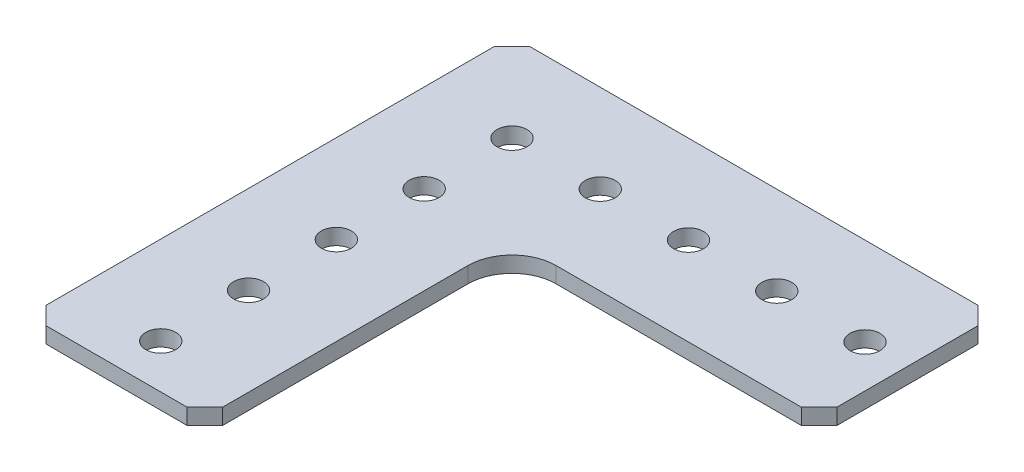
ISO-10303-21;
HEADER;
FILE_DESCRIPTION(('STEP AP214'),'2;1');
FILE_NAME('part.step','',(''),(''),'','','');
FILE_SCHEMA(('AUTOMOTIVE_DESIGN { 1 0 10303 214 1 1 1 1 }'));
ENDSEC;
DATA;
#1=APPLICATION_CONTEXT('core data for automotive mechanical design processes');
#2=APPLICATION_PROTOCOL_DEFINITION('international standard','automotive_design',2000,#1);
#3=PRODUCT_CONTEXT('',#1,'mechanical');
#4=PRODUCT('Part','Part','',(#3));
#5=PRODUCT_RELATED_PRODUCT_CATEGORY('part','',(#4));
#6=PRODUCT_DEFINITION_FORMATION('','',#4);
#7=PRODUCT_DEFINITION_CONTEXT('part definition',#1,'design');
#8=PRODUCT_DEFINITION('design','',#6,#7);
#9=PRODUCT_DEFINITION_SHAPE('','',#8);
#10=(LENGTH_UNIT() NAMED_UNIT(*) SI_UNIT(.MILLI.,.METRE.));
#11=(NAMED_UNIT(*) PLANE_ANGLE_UNIT() SI_UNIT($,.RADIAN.));
#12=(NAMED_UNIT(*) SI_UNIT($,.STERADIAN.) SOLID_ANGLE_UNIT());
#13=UNCERTAINTY_MEASURE_WITH_UNIT(LENGTH_MEASURE(1.E-05),#10,'distance_accuracy_value','');
#14=(GEOMETRIC_REPRESENTATION_CONTEXT(3) GLOBAL_UNCERTAINTY_ASSIGNED_CONTEXT((#13)) GLOBAL_UNIT_ASSIGNED_CONTEXT((#10,
#11,#12)) REPRESENTATION_CONTEXT('',''));
#15=CARTESIAN_POINT('',(0.,0.,0.));
#16=DIRECTION('',(0.,0.,1.));
#17=DIRECTION('',(1.,0.,0.));
#18=AXIS2_PLACEMENT_3D('',#15,#16,#17);
#19=CARTESIAN_POINT('',(-7.73686434568832,2.286,-7.93225292998995));
#20=DIRECTION('',(0.,1.,0.));
#21=DIRECTION('',(0.,0.,1.));
#22=AXIS2_PLACEMENT_3D('',#19,#20,#21);
#23=PLANE('',#22);
#24=CARTESIAN_POINT('',(-26.7868643456951,2.286,10.927247070011));
#25=DIRECTION('',(0.,1.,0.));
#26=DIRECTION('',(0.,0.,1.));
#27=AXIS2_PLACEMENT_3D('',#24,#25,#26);
#28=CIRCLE('',#27,2.15900000000763);
#29=CARTESIAN_POINT('',(-26.7868643456951,2.286,13.0862470700186));
#30=VERTEX_POINT('',#29);
#31=EDGE_CURVE('E352',#30,#30,#28,.T.);
#32=ORIENTED_EDGE('',*,*,#31,.F.);
#33=EDGE_LOOP('',(#32));
#34=FACE_BOUND('',#33,.T.);
#35=CARTESIAN_POINT('',(-26.7868643456954,2.286,-14.3457529299895));
#36=DIRECTION('',(0.,1.,0.));
#37=DIRECTION('',(0.,0.,1.));
#38=AXIS2_PLACEMENT_3D('',#35,#36,#37);
#39=CIRCLE('',#38,2.15900000000757);
#40=CARTESIAN_POINT('',(-26.7868643456954,2.286,-12.1867529299819));
#41=VERTEX_POINT('',#40);
#42=EDGE_CURVE('E368',#41,#41,#39,.T.);
#43=ORIENTED_EDGE('',*,*,#42,.F.);
#44=EDGE_LOOP('',(#43));
#45=FACE_BOUND('',#44,.T.);
#46=CARTESIAN_POINT('',(11.3131356543094,2.286,-26.9822529299906));
#47=DIRECTION('',(0.,1.,0.));
#48=DIRECTION('',(0.,0.,1.));
#49=AXIS2_PLACEMENT_3D('',#46,#47,#48);
#50=CIRCLE('',#49,2.15900000000558);
#51=CARTESIAN_POINT('',(11.3131356543094,2.286,-24.8232529299851));
#52=VERTEX_POINT('',#51);
#53=EDGE_CURVE('E384',#52,#52,#50,.T.);
#54=ORIENTED_EDGE('',*,*,#53,.F.);
#55=EDGE_LOOP('',(#54));
#56=FACE_BOUND('',#55,.T.);
#57=CARTESIAN_POINT('',(-14.086864345694,2.286,-26.9822529299899));
#58=DIRECTION('',(0.,1.,0.));
#59=DIRECTION('',(0.,0.,1.));
#60=AXIS2_PLACEMENT_3D('',#57,#58,#59);
#61=CIRCLE('',#60,2.15900000000892);
#62=CARTESIAN_POINT('',(-14.086864345694,2.286,-24.823252929981));
#63=VERTEX_POINT('',#62);
#64=EDGE_CURVE('E400',#63,#63,#61,.T.);
#65=ORIENTED_EDGE('',*,*,#64,.F.);
#66=EDGE_LOOP('',(#65));
#67=FACE_BOUND('',#66,.T.);
#68=DIRECTION('',(-0.707106781186537,0.,0.707106781186558));
#69=VECTOR('',#68,1.);
#70=CARTESIAN_POINT('',(-39.4868643456896,2.286,-37.1422529299886));
#71=LINE('',#70,#69);
#72=CARTESIAN_POINT('',(-36.9468643456897,2.286,-39.6822529299886));
#73=VERTEX_POINT('',#72);
#74=CARTESIAN_POINT('',(-39.4868643456896,2.286,-37.1422529299886));
#75=VERTEX_POINT('',#74);
#76=EDGE_CURVE('E200',#73,#75,#71,.T.);
#77=ORIENTED_EDGE('',*,*,#76,.T.);
#78=DIRECTION('',(0.,0.,1.));
#79=VECTOR('',#78,1.);
#80=CARTESIAN_POINT('',(-39.4868643456887,2.286,27.3737470700114));
#81=LINE('',#80,#79);
#82=CARTESIAN_POINT('',(-39.4868643456887,2.286,27.3737470700114));
#83=VERTEX_POINT('',#82);
#84=EDGE_CURVE('E112',#75,#83,#81,.T.);
#85=ORIENTED_EDGE('',*,*,#84,.T.);
#86=DIRECTION('',(0.707106781186556,0.,0.707106781186539));
#87=VECTOR('',#86,1.);
#88=CARTESIAN_POINT('',(-36.9468643456887,2.286,29.9137470700114));
#89=LINE('',#88,#87);
#90=CARTESIAN_POINT('',(-36.9468643456887,2.286,29.9137470700114));
#91=VERTEX_POINT('',#90);
#92=EDGE_CURVE('E237',#83,#91,#89,.T.);
#93=ORIENTED_EDGE('',*,*,#92,.T.);
#94=DIRECTION('',(1.,0.,0.));
#95=VECTOR('',#94,1.);
#96=CARTESIAN_POINT('',(-16.6268643456887,2.286,29.9137470700111));
#97=LINE('',#96,#95);
#98=CARTESIAN_POINT('',(-16.6268643456887,2.286,29.9137470700111));
#99=VERTEX_POINT('',#98);
#100=EDGE_CURVE('E257',#91,#99,#97,.T.);
#101=ORIENTED_EDGE('',*,*,#100,.T.);
#102=DIRECTION('',(0.707106781186543,0.,-0.707106781186552));
#103=VECTOR('',#102,1.);
#104=CARTESIAN_POINT('',(-14.0868643456887,2.286,27.3737470700111));
#105=LINE('',#104,#103);
#106=CARTESIAN_POINT('',(-14.0868643456887,2.286,27.3737470700111));
#107=VERTEX_POINT('',#106);
#108=EDGE_CURVE('E253',#99,#107,#105,.T.);
#109=ORIENTED_EDGE('',*,*,#108,.T.);
#110=DIRECTION('',(0.,0.,-1.));
#111=VECTOR('',#110,1.);
#112=CARTESIAN_POINT('',(-14.0868643456883,2.286,-7.93225292998995));
#113=LINE('',#112,#111);
#114=CARTESIAN_POINT('',(-14.0868643456883,2.286,-7.93225292998995));
#115=VERTEX_POINT('',#114);
#116=EDGE_CURVE('E256',#107,#115,#113,.T.);
#117=ORIENTED_EDGE('',*,*,#116,.T.);
#118=CARTESIAN_POINT('',(-7.73686434568832,2.286,-7.93225292998995));
#119=DIRECTION('',(0.,-1.,0.));
#120=DIRECTION('',(0.,0.,1.));
#121=AXIS2_PLACEMENT_3D('',#118,#119,#120);
#122=CIRCLE('',#121,6.35);
#123=CARTESIAN_POINT('',(-7.73686434568832,2.286,-14.2822529299899));
#124=VERTEX_POINT('',#123);
#125=EDGE_CURVE('E261',#115,#124,#122,.T.);
#126=ORIENTED_EDGE('',*,*,#125,.T.);
#127=DIRECTION('',(1.,0.,0.));
#128=VECTOR('',#127,1.);
#129=CARTESIAN_POINT('',(27.5691356543107,2.286,-14.2822529299896));
#130=LINE('',#129,#128);
#131=CARTESIAN_POINT('',(27.5691356543107,2.286,-14.2822529299896));
#132=VERTEX_POINT('',#131);
#133=EDGE_CURVE('E268',#124,#132,#130,.T.);
#134=ORIENTED_EDGE('',*,*,#133,.T.);
#135=DIRECTION('',(0.707106781186542,0.,-0.707106781186553));
#136=VECTOR('',#135,1.);
#137=CARTESIAN_POINT('',(30.1091356543107,2.286,-16.8222529299896));
#138=LINE('',#137,#136);
#139=CARTESIAN_POINT('',(30.1091356543107,2.286,-16.8222529299896));
#140=VERTEX_POINT('',#139);
#141=EDGE_CURVE('E143',#132,#140,#138,.T.);
#142=ORIENTED_EDGE('',*,*,#141,.T.);
#143=DIRECTION('',(0.,0.,-1.));
#144=VECTOR('',#143,1.);
#145=CARTESIAN_POINT('',(30.1091356543104,2.286,-37.1422529299896));
#146=LINE('',#145,#144);
#147=CARTESIAN_POINT('',(30.1091356543104,2.286,-37.1422529299896));
#148=VERTEX_POINT('',#147);
#149=EDGE_CURVE('E137',#140,#148,#146,.T.);
#150=ORIENTED_EDGE('',*,*,#149,.T.);
#151=DIRECTION('',(-0.707106781186555,0.,-0.70710678118654));
#152=VECTOR('',#151,1.);
#153=CARTESIAN_POINT('',(27.5691356543103,2.286,-39.6822529299896));
#154=LINE('',#153,#152);
#155=CARTESIAN_POINT('',(27.5691356543103,2.286,-39.6822529299896));
#156=VERTEX_POINT('',#155);
#157=EDGE_CURVE('E141',#148,#156,#154,.T.);
#158=ORIENTED_EDGE('',*,*,#157,.T.);
#159=DIRECTION('',(-1.,0.,0.));
#160=VECTOR('',#159,1.);
#161=CARTESIAN_POINT('',(-36.9468643456897,2.286,-39.6822529299886));
#162=LINE('',#161,#160);
#163=EDGE_CURVE('E57',#156,#73,#162,.T.);
#164=ORIENTED_EDGE('',*,*,#163,.T.);
#165=EDGE_LOOP('',(#77,#85,#93,#101,#109,#117,#126,#134,#142,#150,#158,#164));
#166=FACE_BOUND('',#165,.T.);
#167=CARTESIAN_POINT('',(-26.7868643456955,2.286,-26.9822529299897));
#168=DIRECTION('',(0.,1.,0.));
#169=DIRECTION('',(0.,0.,1.));
#170=AXIS2_PLACEMENT_3D('',#167,#168,#169);
#171=CIRCLE('',#170,2.15900000001037);
#172=CARTESIAN_POINT('',(-26.7868643456955,2.286,-24.8232529299794));
#173=VERTEX_POINT('',#172);
#174=EDGE_CURVE('E170',#173,#173,#171,.T.);
#175=ORIENTED_EDGE('',*,*,#174,.F.);
#176=EDGE_LOOP('',(#175));
#177=FACE_BOUND('',#176,.T.);
#178=CARTESIAN_POINT('',(-1.3868643456925,2.286,-26.9822529299901));
#179=DIRECTION('',(0.,1.,0.));
#180=DIRECTION('',(0.,0.,1.));
#181=AXIS2_PLACEMENT_3D('',#178,#179,#180);
#182=CIRCLE('',#181,2.15900000000748);
#183=CARTESIAN_POINT('',(-1.3868643456925,2.286,-24.8232529299826));
#184=VERTEX_POINT('',#183);
#185=EDGE_CURVE('E392',#184,#184,#182,.T.);
#186=ORIENTED_EDGE('',*,*,#185,.F.);
#187=EDGE_LOOP('',(#186));
#188=FACE_BOUND('',#187,.T.);
#189=CARTESIAN_POINT('',(24.0131356543105,2.286,-26.9822529299905));
#190=DIRECTION('',(0.,1.,0.));
#191=DIRECTION('',(0.,0.,1.));
#192=AXIS2_PLACEMENT_3D('',#189,#190,#191);
#193=CIRCLE('',#192,2.1590000000046);
#194=CARTESIAN_POINT('',(24.0131356543105,2.286,-24.8232529299859));
#195=VERTEX_POINT('',#194);
#196=EDGE_CURVE('E376',#195,#195,#193,.T.);
#197=ORIENTED_EDGE('',*,*,#196,.F.);
#198=EDGE_LOOP('',(#197));
#199=FACE_BOUND('',#198,.T.);
#200=CARTESIAN_POINT('',(-26.7868643456953,2.286,-1.70925292998925));
#201=DIRECTION('',(0.,1.,0.));
#202=DIRECTION('',(0.,0.,1.));
#203=AXIS2_PLACEMENT_3D('',#200,#201,#202);
#204=CIRCLE('',#203,2.1590000000076);
#205=CARTESIAN_POINT('',(-26.7868643456953,2.286,0.449747070018347));
#206=VERTEX_POINT('',#205);
#207=EDGE_CURVE('E360',#206,#206,#204,.T.);
#208=ORIENTED_EDGE('',*,*,#207,.F.);
#209=EDGE_LOOP('',(#208));
#210=FACE_BOUND('',#209,.T.);
#211=CARTESIAN_POINT('',(-26.7868643456948,2.286,23.5637470700112));
#212=DIRECTION('',(0.,1.,0.));
#213=DIRECTION('',(0.,0.,1.));
#214=AXIS2_PLACEMENT_3D('',#211,#212,#213);
#215=CIRCLE('',#214,2.15900000000766);
#216=CARTESIAN_POINT('',(-26.7868643456948,2.286,25.7227470700189));
#217=VERTEX_POINT('',#216);
#218=EDGE_CURVE('E341',#217,#217,#215,.T.);
#219=ORIENTED_EDGE('',*,*,#218,.F.);
#220=EDGE_LOOP('',(#219));
#221=FACE_BOUND('',#220,.T.);
#222=ADVANCED_FACE('F39',(#34,#45,#56,#67,#166,#177,#188,#199,#210,#221),#23,.T.);
#223=CARTESIAN_POINT('',(-7.73686434568832,0.,-7.93225292998995));
#224=DIRECTION('',(0.,1.,0.));
#225=DIRECTION('',(0.,0.,1.));
#226=AXIS2_PLACEMENT_3D('',#223,#224,#225);
#227=PLANE('',#226);
#228=DIRECTION('',(-0.707106781186537,0.,0.707106781186558));
#229=VECTOR('',#228,1.);
#230=CARTESIAN_POINT('',(-39.4868643456896,0.,-37.1422529299886));
#231=LINE('',#230,#229);
#232=CARTESIAN_POINT('',(-36.9468643456897,0.,-39.6822529299886));
#233=VERTEX_POINT('',#232);
#234=CARTESIAN_POINT('',(-39.4868643456896,0.,-37.1422529299886));
#235=VERTEX_POINT('',#234);
#236=EDGE_CURVE('E165',#233,#235,#231,.T.);
#237=ORIENTED_EDGE('',*,*,#236,.F.);
#238=DIRECTION('',(-1.,0.,0.));
#239=VECTOR('',#238,1.);
#240=CARTESIAN_POINT('',(-36.9468643456897,0.,-39.6822529299886));
#241=LINE('',#240,#239);
#242=CARTESIAN_POINT('',(27.5691356543103,0.,-39.6822529299896));
#243=VERTEX_POINT('',#242);
#244=EDGE_CURVE('E104',#243,#233,#241,.T.);
#245=ORIENTED_EDGE('',*,*,#244,.F.);
#246=DIRECTION('',(-0.707106781186555,0.,-0.70710678118654));
#247=VECTOR('',#246,1.);
#248=CARTESIAN_POINT('',(27.5691356543103,0.,-39.6822529299896));
#249=LINE('',#248,#247);
#250=CARTESIAN_POINT('',(30.1091356543104,0.,-37.1422529299896));
#251=VERTEX_POINT('',#250);
#252=EDGE_CURVE('E98',#251,#243,#249,.T.);
#253=ORIENTED_EDGE('',*,*,#252,.F.);
#254=DIRECTION('',(0.,0.,-1.));
#255=VECTOR('',#254,1.);
#256=CARTESIAN_POINT('',(30.1091356543104,0.,-37.1422529299896));
#257=LINE('',#256,#255);
#258=CARTESIAN_POINT('',(30.1091356543107,0.,-16.8222529299896));
#259=VERTEX_POINT('',#258);
#260=EDGE_CURVE('E152',#259,#251,#257,.T.);
#261=ORIENTED_EDGE('',*,*,#260,.F.);
#262=DIRECTION('',(0.707106781186542,0.,-0.707106781186553));
#263=VECTOR('',#262,1.);
#264=CARTESIAN_POINT('',(30.1091356543107,0.,-16.8222529299896));
#265=LINE('',#264,#263);
#266=CARTESIAN_POINT('',(27.5691356543107,0.,-14.2822529299896));
#267=VERTEX_POINT('',#266);
#268=EDGE_CURVE('E191',#267,#259,#265,.T.);
#269=ORIENTED_EDGE('',*,*,#268,.F.);
#270=DIRECTION('',(1.,0.,0.));
#271=VECTOR('',#270,1.);
#272=CARTESIAN_POINT('',(27.5691356543107,0.,-14.2822529299896));
#273=LINE('',#272,#271);
#274=CARTESIAN_POINT('',(-7.73686434568832,0.,-14.2822529299899));
#275=VERTEX_POINT('',#274);
#276=EDGE_CURVE('E188',#275,#267,#273,.T.);
#277=ORIENTED_EDGE('',*,*,#276,.F.);
#278=CARTESIAN_POINT('',(-7.73686434568832,0.,-7.93225292998995));
#279=DIRECTION('',(0.,-1.,0.));
#280=DIRECTION('',(0.,0.,1.));
#281=AXIS2_PLACEMENT_3D('',#278,#279,#280);
#282=CIRCLE('',#281,6.35);
#283=CARTESIAN_POINT('',(-14.0868643456883,0.,-7.93225292998995));
#284=VERTEX_POINT('',#283);
#285=EDGE_CURVE('E185',#284,#275,#282,.T.);
#286=ORIENTED_EDGE('',*,*,#285,.F.);
#287=DIRECTION('',(0.,0.,-1.));
#288=VECTOR('',#287,1.);
#289=CARTESIAN_POINT('',(-14.0868643456883,0.,-7.93225292998995));
#290=LINE('',#289,#288);
#291=CARTESIAN_POINT('',(-14.0868643456887,0.,27.3737470700111));
#292=VERTEX_POINT('',#291);
#293=EDGE_CURVE('E182',#292,#284,#290,.T.);
#294=ORIENTED_EDGE('',*,*,#293,.F.);
#295=DIRECTION('',(0.707106781186543,0.,-0.707106781186552));
#296=VECTOR('',#295,1.);
#297=CARTESIAN_POINT('',(-14.0868643456887,0.,27.3737470700111));
#298=LINE('',#297,#296);
#299=CARTESIAN_POINT('',(-16.6268643456887,0.,29.9137470700111));
#300=VERTEX_POINT('',#299);
#301=EDGE_CURVE('E179',#300,#292,#298,.T.);
#302=ORIENTED_EDGE('',*,*,#301,.F.);
#303=DIRECTION('',(1.,0.,0.));
#304=VECTOR('',#303,1.);
#305=CARTESIAN_POINT('',(-16.6268643456887,0.,29.9137470700111));
#306=LINE('',#305,#304);
#307=CARTESIAN_POINT('',(-36.9468643456887,0.,29.9137470700114));
#308=VERTEX_POINT('',#307);
#309=EDGE_CURVE('E176',#308,#300,#306,.T.);
#310=ORIENTED_EDGE('',*,*,#309,.F.);
#311=DIRECTION('',(0.707106781186556,0.,0.707106781186539));
#312=VECTOR('',#311,1.);
#313=CARTESIAN_POINT('',(-36.9468643456887,0.,29.9137470700114));
#314=LINE('',#313,#312);
#315=CARTESIAN_POINT('',(-39.4868643456887,0.,27.3737470700114));
#316=VERTEX_POINT('',#315);
#317=EDGE_CURVE('E173',#316,#308,#314,.T.);
#318=ORIENTED_EDGE('',*,*,#317,.F.);
#319=DIRECTION('',(0.,0.,1.));
#320=VECTOR('',#319,1.);
#321=CARTESIAN_POINT('',(-39.4868643456887,0.,27.3737470700114));
#322=LINE('',#321,#320);
#323=EDGE_CURVE('E169',#235,#316,#322,.T.);
#324=ORIENTED_EDGE('',*,*,#323,.F.);
#325=EDGE_LOOP('',(#237,#245,#253,#261,#269,#277,#286,#294,#302,#310,#318,#324));
#326=FACE_BOUND('',#325,.T.);
#327=CARTESIAN_POINT('',(-26.7868643456955,0.,-26.9822529299897));
#328=DIRECTION('',(0.,1.,0.));
#329=DIRECTION('',(0.,0.,1.));
#330=AXIS2_PLACEMENT_3D('',#327,#328,#329);
#331=CIRCLE('',#330,2.15900000001037);
#332=CARTESIAN_POINT('',(-26.7868643456955,0.,-24.8232529299794));
#333=VERTEX_POINT('',#332);
#334=EDGE_CURVE('E404',#333,#333,#331,.T.);
#335=ORIENTED_EDGE('',*,*,#334,.T.);
#336=EDGE_LOOP('',(#335));
#337=FACE_BOUND('',#336,.T.);
#338=CARTESIAN_POINT('',(-14.086864345694,0.,-26.9822529299899));
#339=DIRECTION('',(0.,1.,0.));
#340=DIRECTION('',(0.,0.,1.));
#341=AXIS2_PLACEMENT_3D('',#338,#339,#340);
#342=CIRCLE('',#341,2.15900000000892);
#343=CARTESIAN_POINT('',(-14.086864345694,0.,-24.823252929981));
#344=VERTEX_POINT('',#343);
#345=EDGE_CURVE('E396',#344,#344,#342,.T.);
#346=ORIENTED_EDGE('',*,*,#345,.T.);
#347=EDGE_LOOP('',(#346));
#348=FACE_BOUND('',#347,.T.);
#349=CARTESIAN_POINT('',(-1.3868643456925,0.,-26.9822529299901));
#350=DIRECTION('',(0.,1.,0.));
#351=DIRECTION('',(0.,0.,1.));
#352=AXIS2_PLACEMENT_3D('',#349,#350,#351);
#353=CIRCLE('',#352,2.15900000000748);
#354=CARTESIAN_POINT('',(-1.3868643456925,0.,-24.8232529299826));
#355=VERTEX_POINT('',#354);
#356=EDGE_CURVE('E388',#355,#355,#353,.T.);
#357=ORIENTED_EDGE('',*,*,#356,.T.);
#358=EDGE_LOOP('',(#357));
#359=FACE_BOUND('',#358,.T.);
#360=CARTESIAN_POINT('',(11.3131356543094,0.,-26.9822529299906));
#361=DIRECTION('',(0.,1.,0.));
#362=DIRECTION('',(0.,0.,1.));
#363=AXIS2_PLACEMENT_3D('',#360,#361,#362);
#364=CIRCLE('',#363,2.15900000000558);
#365=CARTESIAN_POINT('',(11.3131356543094,0.,-24.8232529299851));
#366=VERTEX_POINT('',#365);
#367=EDGE_CURVE('E380',#366,#366,#364,.T.);
#368=ORIENTED_EDGE('',*,*,#367,.T.);
#369=EDGE_LOOP('',(#368));
#370=FACE_BOUND('',#369,.T.);
#371=CARTESIAN_POINT('',(24.0131356543105,0.,-26.9822529299905));
#372=DIRECTION('',(0.,1.,0.));
#373=DIRECTION('',(0.,0.,1.));
#374=AXIS2_PLACEMENT_3D('',#371,#372,#373);
#375=CIRCLE('',#374,2.1590000000046);
#376=CARTESIAN_POINT('',(24.0131356543105,0.,-24.8232529299859));
#377=VERTEX_POINT('',#376);
#378=EDGE_CURVE('E372',#377,#377,#375,.T.);
#379=ORIENTED_EDGE('',*,*,#378,.T.);
#380=EDGE_LOOP('',(#379));
#381=FACE_BOUND('',#380,.T.);
#382=CARTESIAN_POINT('',(-26.7868643456954,0.,-14.3457529299895));
#383=DIRECTION('',(0.,1.,0.));
#384=DIRECTION('',(0.,0.,1.));
#385=AXIS2_PLACEMENT_3D('',#382,#383,#384);
#386=CIRCLE('',#385,2.15900000000757);
#387=CARTESIAN_POINT('',(-26.7868643456954,0.,-12.1867529299819));
#388=VERTEX_POINT('',#387);
#389=EDGE_CURVE('E364',#388,#388,#386,.T.);
#390=ORIENTED_EDGE('',*,*,#389,.T.);
#391=EDGE_LOOP('',(#390));
#392=FACE_BOUND('',#391,.T.);
#393=CARTESIAN_POINT('',(-26.7868643456953,0.,-1.70925292998925));
#394=DIRECTION('',(0.,1.,0.));
#395=DIRECTION('',(0.,0.,1.));
#396=AXIS2_PLACEMENT_3D('',#393,#394,#395);
#397=CIRCLE('',#396,2.1590000000076);
#398=CARTESIAN_POINT('',(-26.7868643456953,0.,0.449747070018347));
#399=VERTEX_POINT('',#398);
#400=EDGE_CURVE('E356',#399,#399,#397,.T.);
#401=ORIENTED_EDGE('',*,*,#400,.T.);
#402=EDGE_LOOP('',(#401));
#403=FACE_BOUND('',#402,.T.);
#404=CARTESIAN_POINT('',(-26.7868643456951,0.,10.927247070011));
#405=DIRECTION('',(0.,1.,0.));
#406=DIRECTION('',(0.,0.,1.));
#407=AXIS2_PLACEMENT_3D('',#404,#405,#406);
#408=CIRCLE('',#407,2.15900000000763);
#409=CARTESIAN_POINT('',(-26.7868643456951,0.,13.0862470700186));
#410=VERTEX_POINT('',#409);
#411=EDGE_CURVE('E349',#410,#410,#408,.T.);
#412=ORIENTED_EDGE('',*,*,#411,.T.);
#413=EDGE_LOOP('',(#412));
#414=FACE_BOUND('',#413,.T.);
#415=CARTESIAN_POINT('',(-26.7868643456948,0.,23.5637470700112));
#416=DIRECTION('',(0.,1.,0.));
#417=DIRECTION('',(0.,0.,1.));
#418=AXIS2_PLACEMENT_3D('',#415,#416,#417);
#419=CIRCLE('',#418,2.15900000000766);
#420=CARTESIAN_POINT('',(-26.7868643456948,0.,25.7227470700189));
#421=VERTEX_POINT('',#420);
#422=EDGE_CURVE('E344',#421,#421,#419,.T.);
#423=ORIENTED_EDGE('',*,*,#422,.T.);
#424=EDGE_LOOP('',(#423));
#425=FACE_BOUND('',#424,.T.);
#426=ADVANCED_FACE('F241',(#326,#337,#348,#359,#370,#381,#392,#403,#414,#425),#227,.F.);
#427=CARTESIAN_POINT('',(-39.4868643456896,2.286,-37.1422529299886));
#428=DIRECTION('',(0.707106781186558,0.,0.707106781186537));
#429=DIRECTION('',(0.707106781186537,0.,-0.707106781186558));
#430=AXIS2_PLACEMENT_3D('',#427,#428,#429);
#431=PLANE('',#430);
#432=ORIENTED_EDGE('',*,*,#236,.T.);
#433=DIRECTION('',(0.,-1.,0.));
#434=VECTOR('',#433,1.);
#435=CARTESIAN_POINT('',(-39.4868643456896,2.286,-37.1422529299886));
#436=LINE('',#435,#434);
#437=EDGE_CURVE('E11',#75,#235,#436,.T.);
#438=ORIENTED_EDGE('',*,*,#437,.F.);
#439=ORIENTED_EDGE('',*,*,#76,.F.);
#440=DIRECTION('',(0.,-1.,0.));
#441=VECTOR('',#440,1.);
#442=CARTESIAN_POINT('',(-36.9468643456897,2.286,-39.6822529299886));
#443=LINE('',#442,#441);
#444=EDGE_CURVE('E161',#73,#233,#443,.T.);
#445=ORIENTED_EDGE('',*,*,#444,.T.);
#446=EDGE_LOOP('',(#432,#438,#439,#445));
#447=FACE_BOUND('',#446,.T.);
#448=ADVANCED_FACE('F41',(#447),#431,.F.);
#449=CARTESIAN_POINT('',(-39.4868643456887,2.286,27.3737470700114));
#450=DIRECTION('',(1.,0.,0.));
#451=DIRECTION('',(0.,0.,-1.));
#452=AXIS2_PLACEMENT_3D('',#449,#450,#451);
#453=PLANE('',#452);
#454=ORIENTED_EDGE('',*,*,#323,.T.);
#455=DIRECTION('',(0.,-1.,0.));
#456=VECTOR('',#455,1.);
#457=CARTESIAN_POINT('',(-39.4868643456887,2.286,27.3737470700114));
#458=LINE('',#457,#456);
#459=EDGE_CURVE('E49',#83,#316,#458,.T.);
#460=ORIENTED_EDGE('',*,*,#459,.F.);
#461=ORIENTED_EDGE('',*,*,#84,.F.);
#462=ORIENTED_EDGE('',*,*,#437,.T.);
#463=EDGE_LOOP('',(#454,#460,#461,#462));
#464=FACE_BOUND('',#463,.T.);
#465=ADVANCED_FACE('F565',(#464),#453,.F.);
#466=CARTESIAN_POINT('',(-36.9468643456887,2.286,29.9137470700114));
#467=DIRECTION('',(0.707106781186539,0.,-0.707106781186556));
#468=DIRECTION('',(-0.707106781186556,0.,-0.707106781186539));
#469=AXIS2_PLACEMENT_3D('',#466,#467,#468);
#470=PLANE('',#469);
#471=ORIENTED_EDGE('',*,*,#317,.T.);
#472=DIRECTION('',(0.,-1.,0.));
#473=VECTOR('',#472,1.);
#474=CARTESIAN_POINT('',(-36.9468643456887,2.286,29.9137470700114));
#475=LINE('',#474,#473);
#476=EDGE_CURVE('E227',#91,#308,#475,.T.);
#477=ORIENTED_EDGE('',*,*,#476,.F.);
#478=ORIENTED_EDGE('',*,*,#92,.F.);
#479=ORIENTED_EDGE('',*,*,#459,.T.);
#480=EDGE_LOOP('',(#471,#477,#478,#479));
#481=FACE_BOUND('',#480,.T.);
#482=ADVANCED_FACE('F235',(#481),#470,.F.);
#483=CARTESIAN_POINT('',(-16.6268643456887,2.286,29.9137470700111));
#484=DIRECTION('',(0.,0.,-1.));
#485=DIRECTION('',(-1.,0.,0.));
#486=AXIS2_PLACEMENT_3D('',#483,#484,#485);
#487=PLANE('',#486);
#488=ORIENTED_EDGE('',*,*,#309,.T.);
#489=DIRECTION('',(0.,-1.,0.));
#490=VECTOR('',#489,1.);
#491=CARTESIAN_POINT('',(-16.6268643456887,2.286,29.9137470700111));
#492=LINE('',#491,#490);
#493=EDGE_CURVE('E223',#99,#300,#492,.T.);
#494=ORIENTED_EDGE('',*,*,#493,.F.);
#495=ORIENTED_EDGE('',*,*,#100,.F.);
#496=ORIENTED_EDGE('',*,*,#476,.T.);
#497=EDGE_LOOP('',(#488,#494,#495,#496));
#498=FACE_BOUND('',#497,.T.);
#499=ADVANCED_FACE('F247',(#498),#487,.F.);
#500=CARTESIAN_POINT('',(-14.0868643456887,2.286,27.3737470700111));
#501=DIRECTION('',(-0.707106781186552,0.,-0.707106781186543));
#502=DIRECTION('',(-0.707106781186543,0.,0.707106781186552));
#503=AXIS2_PLACEMENT_3D('',#500,#501,#502);
#504=PLANE('',#503);
#505=ORIENTED_EDGE('',*,*,#301,.T.);
#506=DIRECTION('',(0.,-1.,0.));
#507=VECTOR('',#506,1.);
#508=CARTESIAN_POINT('',(-14.0868643456887,2.286,27.3737470700111));
#509=LINE('',#508,#507);
#510=EDGE_CURVE('E219',#107,#292,#509,.T.);
#511=ORIENTED_EDGE('',*,*,#510,.F.);
#512=ORIENTED_EDGE('',*,*,#108,.F.);
#513=ORIENTED_EDGE('',*,*,#493,.T.);
#514=EDGE_LOOP('',(#505,#511,#512,#513));
#515=FACE_BOUND('',#514,.T.);
#516=ADVANCED_FACE('F251',(#515),#504,.F.);
#517=CARTESIAN_POINT('',(-14.0868643456883,2.286,-7.93225292998995));
#518=DIRECTION('',(-1.,0.,0.));
#519=DIRECTION('',(0.,0.,1.));
#520=AXIS2_PLACEMENT_3D('',#517,#518,#519);
#521=PLANE('',#520);
#522=ORIENTED_EDGE('',*,*,#293,.T.);
#523=DIRECTION('',(0.,-1.,0.));
#524=VECTOR('',#523,1.);
#525=CARTESIAN_POINT('',(-14.0868643456883,2.286,-7.93225292998995));
#526=LINE('',#525,#524);
#527=EDGE_CURVE('E215',#115,#284,#526,.T.);
#528=ORIENTED_EDGE('',*,*,#527,.F.);
#529=ORIENTED_EDGE('',*,*,#116,.F.);
#530=ORIENTED_EDGE('',*,*,#510,.T.);
#531=EDGE_LOOP('',(#522,#528,#529,#530));
#532=FACE_BOUND('',#531,.T.);
#533=ADVANCED_FACE('F530',(#532),#521,.F.);
#534=CARTESIAN_POINT('',(-7.73686434568832,2.286,-7.93225292998995));
#535=DIRECTION('',(0.,-1.,0.));
#536=DIRECTION('',(0.,0.,-1.));
#537=AXIS2_PLACEMENT_3D('',#534,#535,#536);
#538=CYLINDRICAL_SURFACE('',#537,6.35);
#539=ORIENTED_EDGE('',*,*,#285,.T.);
#540=DIRECTION('',(0.,-1.,0.));
#541=VECTOR('',#540,1.);
#542=CARTESIAN_POINT('',(-7.73686434568832,2.286,-14.2822529299899));
#543=LINE('',#542,#541);
#544=EDGE_CURVE('E211',#124,#275,#543,.T.);
#545=ORIENTED_EDGE('',*,*,#544,.F.);
#546=ORIENTED_EDGE('',*,*,#125,.F.);
#547=ORIENTED_EDGE('',*,*,#527,.T.);
#548=EDGE_LOOP('',(#539,#545,#546,#547));
#549=FACE_BOUND('',#548,.T.);
#550=ADVANCED_FACE('F521',(#549),#538,.F.);
#551=CARTESIAN_POINT('',(27.5691356543107,2.286,-14.2822529299896));
#552=DIRECTION('',(0.,0.,-1.));
#553=DIRECTION('',(-1.,0.,0.));
#554=AXIS2_PLACEMENT_3D('',#551,#552,#553);
#555=PLANE('',#554);
#556=ORIENTED_EDGE('',*,*,#276,.T.);
#557=DIRECTION('',(0.,-1.,0.));
#558=VECTOR('',#557,1.);
#559=CARTESIAN_POINT('',(27.5691356543107,2.286,-14.2822529299896));
#560=LINE('',#559,#558);
#561=EDGE_CURVE('E207',#132,#267,#560,.T.);
#562=ORIENTED_EDGE('',*,*,#561,.F.);
#563=ORIENTED_EDGE('',*,*,#133,.F.);
#564=ORIENTED_EDGE('',*,*,#544,.T.);
#565=EDGE_LOOP('',(#556,#562,#563,#564));
#566=FACE_BOUND('',#565,.T.);
#567=ADVANCED_FACE('F276',(#566),#555,.F.);
#568=CARTESIAN_POINT('',(30.1091356543107,2.286,-16.8222529299896));
#569=DIRECTION('',(-0.707106781186553,0.,-0.707106781186542));
#570=DIRECTION('',(-0.707106781186542,0.,0.707106781186553));
#571=AXIS2_PLACEMENT_3D('',#568,#569,#570);
#572=PLANE('',#571);
#573=ORIENTED_EDGE('',*,*,#268,.T.);
#574=DIRECTION('',(0.,-1.,0.));
#575=VECTOR('',#574,1.);
#576=CARTESIAN_POINT('',(30.1091356543107,2.286,-16.8222529299896));
#577=LINE('',#576,#575);
#578=EDGE_CURVE('E154',#140,#259,#577,.T.);
#579=ORIENTED_EDGE('',*,*,#578,.F.);
#580=ORIENTED_EDGE('',*,*,#141,.F.);
#581=ORIENTED_EDGE('',*,*,#561,.T.);
#582=EDGE_LOOP('',(#573,#579,#580,#581));
#583=FACE_BOUND('',#582,.T.);
#584=ADVANCED_FACE('F280',(#583),#572,.F.);
#585=CARTESIAN_POINT('',(30.1091356543104,2.286,-37.1422529299896));
#586=DIRECTION('',(-1.,0.,0.));
#587=DIRECTION('',(0.,0.,1.));
#588=AXIS2_PLACEMENT_3D('',#585,#586,#587);
#589=PLANE('',#588);
#590=ORIENTED_EDGE('',*,*,#260,.T.);
#591=DIRECTION('',(0.,-1.,0.));
#592=VECTOR('',#591,1.);
#593=CARTESIAN_POINT('',(30.1091356543104,2.286,-37.1422529299896));
#594=LINE('',#593,#592);
#595=EDGE_CURVE('E149',#148,#251,#594,.T.);
#596=ORIENTED_EDGE('',*,*,#595,.F.);
#597=ORIENTED_EDGE('',*,*,#149,.F.);
#598=ORIENTED_EDGE('',*,*,#578,.T.);
#599=EDGE_LOOP('',(#590,#596,#597,#598));
#600=FACE_BOUND('',#599,.T.);
#601=ADVANCED_FACE('F150',(#600),#589,.F.);
#602=CARTESIAN_POINT('',(27.5691356543103,2.286,-39.6822529299896));
#603=DIRECTION('',(-0.70710678118654,0.,0.707106781186555));
#604=DIRECTION('',(0.707106781186555,0.,0.70710678118654));
#605=AXIS2_PLACEMENT_3D('',#602,#603,#604);
#606=PLANE('',#605);
#607=ORIENTED_EDGE('',*,*,#252,.T.);
#608=DIRECTION('',(0.,-1.,0.));
#609=VECTOR('',#608,1.);
#610=CARTESIAN_POINT('',(27.5691356543103,2.286,-39.6822529299896));
#611=LINE('',#610,#609);
#612=EDGE_CURVE('E155',#156,#243,#611,.T.);
#613=ORIENTED_EDGE('',*,*,#612,.F.);
#614=ORIENTED_EDGE('',*,*,#157,.F.);
#615=ORIENTED_EDGE('',*,*,#595,.T.);
#616=EDGE_LOOP('',(#607,#613,#614,#615));
#617=FACE_BOUND('',#616,.T.);
#618=ADVANCED_FACE('F157',(#617),#606,.F.);
#619=CARTESIAN_POINT('',(-36.9468643456897,2.286,-39.6822529299886));
#620=DIRECTION('',(0.,0.,1.));
#621=DIRECTION('',(1.,0.,0.));
#622=AXIS2_PLACEMENT_3D('',#619,#620,#621);
#623=PLANE('',#622);
#624=ORIENTED_EDGE('',*,*,#244,.T.);
#625=ORIENTED_EDGE('',*,*,#444,.F.);
#626=ORIENTED_EDGE('',*,*,#163,.F.);
#627=ORIENTED_EDGE('',*,*,#612,.T.);
#628=EDGE_LOOP('',(#624,#625,#626,#627));
#629=FACE_BOUND('',#628,.T.);
#630=ADVANCED_FACE('F284',(#629),#623,.F.);
#631=CARTESIAN_POINT('',(-26.7868643456955,2.286,-26.9822529299897));
#632=DIRECTION('',(0.,-1.,0.));
#633=DIRECTION('',(0.,0.,-1.));
#634=AXIS2_PLACEMENT_3D('',#631,#632,#633);
#635=CYLINDRICAL_SURFACE('',#634,2.15900000001037);
#636=ORIENTED_EDGE('',*,*,#174,.T.);
#637=EDGE_LOOP('',(#636));
#638=FACE_BOUND('',#637,.T.);
#639=ORIENTED_EDGE('',*,*,#334,.F.);
#640=EDGE_LOOP('',(#639));
#641=FACE_BOUND('',#640,.T.);
#642=ADVANCED_FACE('F286',(#638,#641),#635,.F.);
#643=CARTESIAN_POINT('',(-14.086864345694,2.286,-26.9822529299899));
#644=DIRECTION('',(0.,-1.,0.));
#645=DIRECTION('',(0.,0.,-1.));
#646=AXIS2_PLACEMENT_3D('',#643,#644,#645);
#647=CYLINDRICAL_SURFACE('',#646,2.15900000000892);
#648=ORIENTED_EDGE('',*,*,#64,.T.);
#649=EDGE_LOOP('',(#648));
#650=FACE_BOUND('',#649,.T.);
#651=ORIENTED_EDGE('',*,*,#345,.F.);
#652=EDGE_LOOP('',(#651));
#653=FACE_BOUND('',#652,.T.);
#654=ADVANCED_FACE('F292',(#650,#653),#647,.F.);
#655=CARTESIAN_POINT('',(-1.3868643456925,2.286,-26.9822529299901));
#656=DIRECTION('',(0.,-1.,0.));
#657=DIRECTION('',(0.,0.,-1.));
#658=AXIS2_PLACEMENT_3D('',#655,#656,#657);
#659=CYLINDRICAL_SURFACE('',#658,2.15900000000748);
#660=ORIENTED_EDGE('',*,*,#185,.T.);
#661=EDGE_LOOP('',(#660));
#662=FACE_BOUND('',#661,.T.);
#663=ORIENTED_EDGE('',*,*,#356,.F.);
#664=EDGE_LOOP('',(#663));
#665=FACE_BOUND('',#664,.T.);
#666=ADVANCED_FACE('F308',(#662,#665),#659,.F.);
#667=CARTESIAN_POINT('',(11.3131356543094,2.286,-26.9822529299906));
#668=DIRECTION('',(0.,-1.,0.));
#669=DIRECTION('',(0.,0.,-1.));
#670=AXIS2_PLACEMENT_3D('',#667,#668,#669);
#671=CYLINDRICAL_SURFACE('',#670,2.15900000000558);
#672=ORIENTED_EDGE('',*,*,#53,.T.);
#673=EDGE_LOOP('',(#672));
#674=FACE_BOUND('',#673,.T.);
#675=ORIENTED_EDGE('',*,*,#367,.F.);
#676=EDGE_LOOP('',(#675));
#677=FACE_BOUND('',#676,.T.);
#678=ADVANCED_FACE('F312',(#674,#677),#671,.F.);
#679=CARTESIAN_POINT('',(24.0131356543105,2.286,-26.9822529299905));
#680=DIRECTION('',(0.,-1.,0.));
#681=DIRECTION('',(0.,0.,-1.));
#682=AXIS2_PLACEMENT_3D('',#679,#680,#681);
#683=CYLINDRICAL_SURFACE('',#682,2.1590000000046);
#684=ORIENTED_EDGE('',*,*,#196,.T.);
#685=EDGE_LOOP('',(#684));
#686=FACE_BOUND('',#685,.T.);
#687=ORIENTED_EDGE('',*,*,#378,.F.);
#688=EDGE_LOOP('',(#687));
#689=FACE_BOUND('',#688,.T.);
#690=ADVANCED_FACE('F316',(#686,#689),#683,.F.);
#691=CARTESIAN_POINT('',(-26.7868643456954,2.286,-14.3457529299895));
#692=DIRECTION('',(0.,-1.,0.));
#693=DIRECTION('',(0.,0.,-1.));
#694=AXIS2_PLACEMENT_3D('',#691,#692,#693);
#695=CYLINDRICAL_SURFACE('',#694,2.15900000000757);
#696=ORIENTED_EDGE('',*,*,#42,.T.);
#697=EDGE_LOOP('',(#696));
#698=FACE_BOUND('',#697,.T.);
#699=ORIENTED_EDGE('',*,*,#389,.F.);
#700=EDGE_LOOP('',(#699));
#701=FACE_BOUND('',#700,.T.);
#702=ADVANCED_FACE('F320',(#698,#701),#695,.F.);
#703=CARTESIAN_POINT('',(-26.7868643456953,2.286,-1.70925292998925));
#704=DIRECTION('',(0.,-1.,0.));
#705=DIRECTION('',(0.,0.,-1.));
#706=AXIS2_PLACEMENT_3D('',#703,#704,#705);
#707=CYLINDRICAL_SURFACE('',#706,2.1590000000076);
#708=ORIENTED_EDGE('',*,*,#207,.T.);
#709=EDGE_LOOP('',(#708));
#710=FACE_BOUND('',#709,.T.);
#711=ORIENTED_EDGE('',*,*,#400,.F.);
#712=EDGE_LOOP('',(#711));
#713=FACE_BOUND('',#712,.T.);
#714=ADVANCED_FACE('F324',(#710,#713),#707,.F.);
#715=CARTESIAN_POINT('',(-26.7868643456951,2.286,10.927247070011));
#716=DIRECTION('',(0.,-1.,0.));
#717=DIRECTION('',(0.,0.,-1.));
#718=AXIS2_PLACEMENT_3D('',#715,#716,#717);
#719=CYLINDRICAL_SURFACE('',#718,2.15900000000763);
#720=ORIENTED_EDGE('',*,*,#31,.T.);
#721=EDGE_LOOP('',(#720));
#722=FACE_BOUND('',#721,.T.);
#723=ORIENTED_EDGE('',*,*,#411,.F.);
#724=EDGE_LOOP('',(#723));
#725=FACE_BOUND('',#724,.T.);
#726=ADVANCED_FACE('F328',(#722,#725),#719,.F.);
#727=CARTESIAN_POINT('',(-26.7868643456948,2.286,23.5637470700112));
#728=DIRECTION('',(0.,-1.,0.));
#729=DIRECTION('',(0.,0.,-1.));
#730=AXIS2_PLACEMENT_3D('',#727,#728,#729);
#731=CYLINDRICAL_SURFACE('',#730,2.15900000000766);
#732=ORIENTED_EDGE('',*,*,#218,.T.);
#733=EDGE_LOOP('',(#732));
#734=FACE_BOUND('',#733,.T.);
#735=ORIENTED_EDGE('',*,*,#422,.F.);
#736=EDGE_LOOP('',(#735));
#737=FACE_BOUND('',#736,.T.);
#738=ADVANCED_FACE('F332',(#734,#737),#731,.F.);
#739=CLOSED_SHELL('',(#222,#426,#448,#465,#482,#499,#516,#533,#550,#567,#584,#601,#618,#630,
#642,#654,#666,#678,#690,#702,#714,#726,#738));
#740=MANIFOLD_SOLID_BREP('B2',#739);
#741=ADVANCED_BREP_SHAPE_REPRESENTATION('',(#18,#740),#14);
#742=SHAPE_DEFINITION_REPRESENTATION(#9,#741);
ENDSEC;
END-ISO-10303-21;
